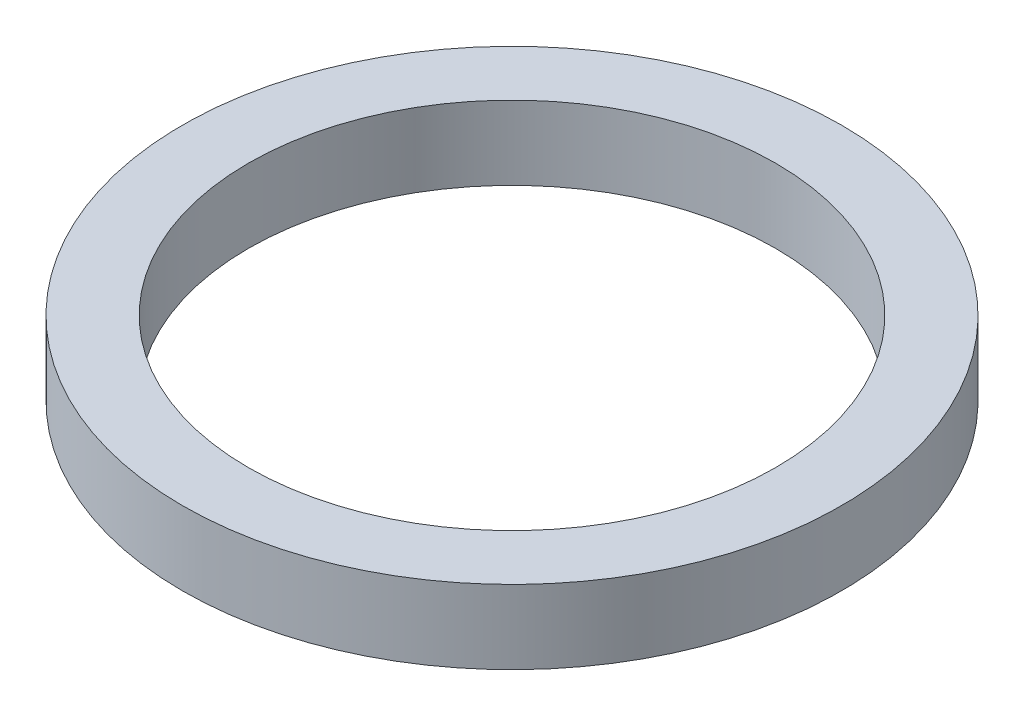
ISO-10303-21;
HEADER;
FILE_DESCRIPTION(('STEP AP214'),'2;1');
FILE_NAME('part.step','',(''),(''),'','','');
FILE_SCHEMA(('AUTOMOTIVE_DESIGN { 1 0 10303 214 1 1 1 1 }'));
ENDSEC;
DATA;
#1=APPLICATION_CONTEXT('core data for automotive mechanical design processes');
#2=APPLICATION_PROTOCOL_DEFINITION('international standard','automotive_design',2000,#1);
#3=PRODUCT_CONTEXT('',#1,'mechanical');
#4=PRODUCT('Part','Part','',(#3));
#5=PRODUCT_RELATED_PRODUCT_CATEGORY('part','',(#4));
#6=PRODUCT_DEFINITION_FORMATION('','',#4);
#7=PRODUCT_DEFINITION_CONTEXT('part definition',#1,'design');
#8=PRODUCT_DEFINITION('design','',#6,#7);
#9=PRODUCT_DEFINITION_SHAPE('','',#8);
#10=(LENGTH_UNIT() NAMED_UNIT(*) SI_UNIT(.MILLI.,.METRE.));
#11=(NAMED_UNIT(*) PLANE_ANGLE_UNIT() SI_UNIT($,.RADIAN.));
#12=(NAMED_UNIT(*) SI_UNIT($,.STERADIAN.) SOLID_ANGLE_UNIT());
#13=UNCERTAINTY_MEASURE_WITH_UNIT(LENGTH_MEASURE(1.E-05),#10,'distance_accuracy_value','');
#14=(GEOMETRIC_REPRESENTATION_CONTEXT(3) GLOBAL_UNCERTAINTY_ASSIGNED_CONTEXT((#13)) GLOBAL_UNIT_ASSIGNED_CONTEXT((#10,
#11,#12)) REPRESENTATION_CONTEXT('',''));
#15=CARTESIAN_POINT('',(0.,0.,0.));
#16=DIRECTION('',(0.,0.,1.));
#17=DIRECTION('',(1.,0.,0.));
#18=AXIS2_PLACEMENT_3D('',#15,#16,#17);
#19=CARTESIAN_POINT('',(0.,14.,0.));
#20=DIRECTION('',(0.,-1.,0.));
#21=DIRECTION('',(0.,0.,-1.));
#22=AXIS2_PLACEMENT_3D('',#19,#20,#21);
#23=CYLINDRICAL_SURFACE('',#22,62.5);
#24=CARTESIAN_POINT('',(0.,14.,0.));
#25=DIRECTION('',(0.,1.,0.));
#26=DIRECTION('',(0.,0.,1.));
#27=AXIS2_PLACEMENT_3D('',#24,#25,#26);
#28=CIRCLE('',#27,62.5);
#29=CARTESIAN_POINT('',(0.,14.,62.5));
#30=VERTEX_POINT('',#29);
#31=EDGE_CURVE('E10',#30,#30,#28,.T.);
#32=ORIENTED_EDGE('',*,*,#31,.F.);
#33=EDGE_LOOP('',(#32));
#34=FACE_BOUND('',#33,.T.);
#35=CARTESIAN_POINT('',(0.,0.,0.));
#36=DIRECTION('',(0.,1.,0.));
#37=DIRECTION('',(0.,0.,1.));
#38=AXIS2_PLACEMENT_3D('',#35,#36,#37);
#39=CIRCLE('',#38,62.5);
#40=CARTESIAN_POINT('',(0.,0.,62.5));
#41=VERTEX_POINT('',#40);
#42=EDGE_CURVE('E37',#41,#41,#39,.T.);
#43=ORIENTED_EDGE('',*,*,#42,.T.);
#44=EDGE_LOOP('',(#43));
#45=FACE_BOUND('',#44,.T.);
#46=ADVANCED_FACE('F40',(#34,#45),#23,.T.);
#47=CARTESIAN_POINT('',(0.,14.,0.));
#48=DIRECTION('',(0.,1.,0.));
#49=DIRECTION('',(0.,0.,1.));
#50=AXIS2_PLACEMENT_3D('',#47,#48,#49);
#51=PLANE('',#50);
#52=CARTESIAN_POINT('',(0.,14.,0.));
#53=DIRECTION('',(0.,1.,0.));
#54=DIRECTION('',(0.,0.,1.));
#55=AXIS2_PLACEMENT_3D('',#52,#53,#54);
#56=CIRCLE('',#55,50.);
#57=CARTESIAN_POINT('',(0.,14.,50.));
#58=VERTEX_POINT('',#57);
#59=EDGE_CURVE('E50',#58,#58,#56,.T.);
#60=ORIENTED_EDGE('',*,*,#59,.F.);
#61=EDGE_LOOP('',(#60));
#62=FACE_BOUND('',#61,.T.);
#63=ORIENTED_EDGE('',*,*,#31,.T.);
#64=EDGE_LOOP('',(#63));
#65=FACE_BOUND('',#64,.T.);
#66=ADVANCED_FACE('F59',(#62,#65),#51,.T.);
#67=CARTESIAN_POINT('',(0.,0.,0.));
#68=DIRECTION('',(0.,1.,0.));
#69=DIRECTION('',(0.,0.,1.));
#70=AXIS2_PLACEMENT_3D('',#67,#68,#69);
#71=PLANE('',#70);
#72=CARTESIAN_POINT('',(0.,0.,0.));
#73=DIRECTION('',(0.,1.,0.));
#74=DIRECTION('',(0.,0.,1.));
#75=AXIS2_PLACEMENT_3D('',#72,#73,#74);
#76=CIRCLE('',#75,50.);
#77=CARTESIAN_POINT('',(0.,0.,50.));
#78=VERTEX_POINT('',#77);
#79=EDGE_CURVE('E47',#78,#78,#76,.T.);
#80=ORIENTED_EDGE('',*,*,#79,.T.);
#81=EDGE_LOOP('',(#80));
#82=FACE_BOUND('',#81,.T.);
#83=ORIENTED_EDGE('',*,*,#42,.F.);
#84=EDGE_LOOP('',(#83));
#85=FACE_BOUND('',#84,.T.);
#86=ADVANCED_FACE('F58',(#82,#85),#71,.F.);
#87=CARTESIAN_POINT('',(0.,14.,0.));
#88=DIRECTION('',(0.,-1.,0.));
#89=DIRECTION('',(0.,0.,-1.));
#90=AXIS2_PLACEMENT_3D('',#87,#88,#89);
#91=CYLINDRICAL_SURFACE('',#90,50.);
#92=ORIENTED_EDGE('',*,*,#59,.T.);
#93=EDGE_LOOP('',(#92));
#94=FACE_BOUND('',#93,.T.);
#95=ORIENTED_EDGE('',*,*,#79,.F.);
#96=EDGE_LOOP('',(#95));
#97=FACE_BOUND('',#96,.T.);
#98=ADVANCED_FACE('F54',(#94,#97),#91,.F.);
#99=CLOSED_SHELL('',(#46,#66,#86,#98));
#100=MANIFOLD_SOLID_BREP('B2',#99);
#101=ADVANCED_BREP_SHAPE_REPRESENTATION('',(#18,#100),#14);
#102=SHAPE_DEFINITION_REPRESENTATION(#9,#101);
ENDSEC;
END-ISO-10303-21;
